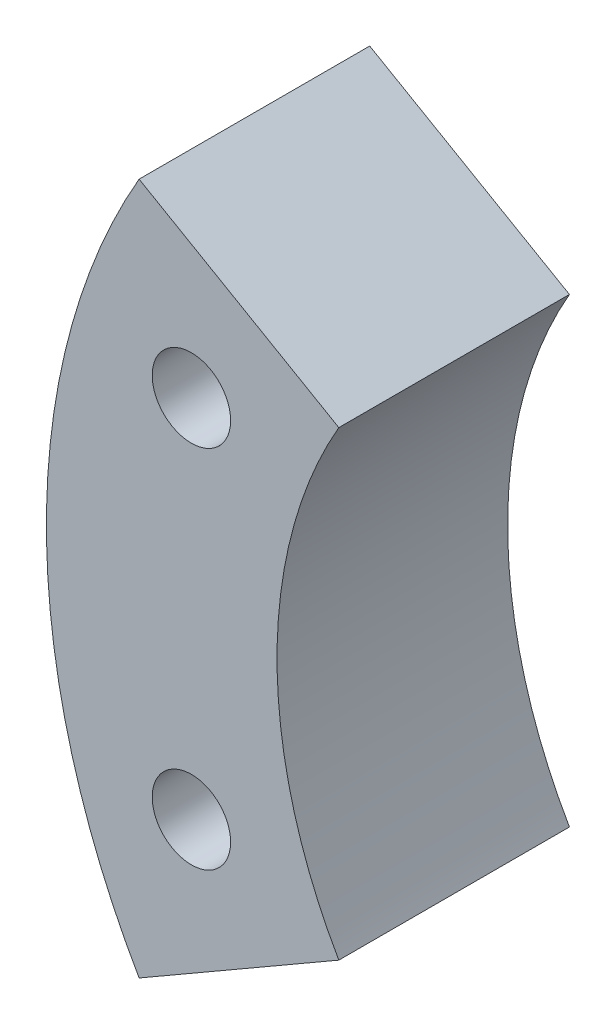
ISO-10303-21;
HEADER;
FILE_DESCRIPTION(('STEP AP214'),'2;1');
FILE_NAME('part.step','',(''),(''),'','','');
FILE_SCHEMA(('AUTOMOTIVE_DESIGN { 1 0 10303 214 1 1 1 1 }'));
ENDSEC;
DATA;
#1=APPLICATION_CONTEXT('core data for automotive mechanical design processes');
#2=APPLICATION_PROTOCOL_DEFINITION('international standard','automotive_design',2000,#1);
#3=PRODUCT_CONTEXT('',#1,'mechanical');
#4=PRODUCT('Part','Part','',(#3));
#5=PRODUCT_RELATED_PRODUCT_CATEGORY('part','',(#4));
#6=PRODUCT_DEFINITION_FORMATION('','',#4);
#7=PRODUCT_DEFINITION_CONTEXT('part definition',#1,'design');
#8=PRODUCT_DEFINITION('design','',#6,#7);
#9=PRODUCT_DEFINITION_SHAPE('','',#8);
#10=(LENGTH_UNIT() NAMED_UNIT(*) SI_UNIT(.MILLI.,.METRE.));
#11=(NAMED_UNIT(*) PLANE_ANGLE_UNIT() SI_UNIT($,.RADIAN.));
#12=(NAMED_UNIT(*) SI_UNIT($,.STERADIAN.) SOLID_ANGLE_UNIT());
#13=UNCERTAINTY_MEASURE_WITH_UNIT(LENGTH_MEASURE(1.E-05),#10,'distance_accuracy_value','');
#14=(GEOMETRIC_REPRESENTATION_CONTEXT(3) GLOBAL_UNCERTAINTY_ASSIGNED_CONTEXT((#13)) GLOBAL_UNIT_ASSIGNED_CONTEXT((#10,
#11,#12)) REPRESENTATION_CONTEXT('',''));
#15=CARTESIAN_POINT('',(0.,0.,0.));
#16=DIRECTION('',(0.,0.,1.));
#17=DIRECTION('',(1.,0.,0.));
#18=AXIS2_PLACEMENT_3D('',#15,#16,#17);
#19=CARTESIAN_POINT('',(0.,0.,6.35));
#20=DIRECTION('',(0.,0.,-1.));
#21=DIRECTION('',(-1.,0.,0.));
#22=AXIS2_PLACEMENT_3D('',#19,#20,#21);
#23=CYLINDRICAL_SURFACE('',#22,19.05);
#24=CARTESIAN_POINT('',(0.,0.,0.));
#25=DIRECTION('',(0.,0.,1.));
#26=DIRECTION('',(1.,0.,0.));
#27=AXIS2_PLACEMENT_3D('',#24,#25,#26);
#28=CIRCLE('',#27,19.05);
#29=CARTESIAN_POINT('',(-16.4977839420936,9.525,0.));
#30=VERTEX_POINT('',#29);
#31=CARTESIAN_POINT('',(-16.4977839420936,-9.525,0.));
#32=VERTEX_POINT('',#31);
#33=EDGE_CURVE('E112',#30,#32,#28,.T.);
#34=ORIENTED_EDGE('',*,*,#33,.T.);
#35=DIRECTION('',(0.,0.,-1.));
#36=VECTOR('',#35,1.);
#37=CARTESIAN_POINT('',(-16.4977839420936,-9.525,6.35));
#38=LINE('',#37,#36);
#39=CARTESIAN_POINT('',(-16.4977839420936,-9.525,6.35));
#40=VERTEX_POINT('',#39);
#41=EDGE_CURVE('E11',#40,#32,#38,.T.);
#42=ORIENTED_EDGE('',*,*,#41,.F.);
#43=CARTESIAN_POINT('',(0.,0.,6.35));
#44=DIRECTION('',(0.,0.,1.));
#45=DIRECTION('',(1.,0.,0.));
#46=AXIS2_PLACEMENT_3D('',#43,#44,#45);
#47=CIRCLE('',#46,19.05);
#48=CARTESIAN_POINT('',(-16.4977839420936,9.525,6.35));
#49=VERTEX_POINT('',#48);
#50=EDGE_CURVE('E96',#49,#40,#47,.T.);
#51=ORIENTED_EDGE('',*,*,#50,.F.);
#52=DIRECTION('',(0.,0.,-1.));
#53=VECTOR('',#52,1.);
#54=CARTESIAN_POINT('',(-16.4977839420936,9.525,6.35));
#55=LINE('',#54,#53);
#56=EDGE_CURVE('E108',#49,#30,#55,.T.);
#57=ORIENTED_EDGE('',*,*,#56,.T.);
#58=EDGE_LOOP('',(#34,#42,#51,#57));
#59=FACE_BOUND('',#58,.T.);
#60=ADVANCED_FACE('F44',(#59),#23,.T.);
#61=CARTESIAN_POINT('',(-16.4977839420936,-9.525,6.35));
#62=DIRECTION('',(-0.5,0.866025403784439,0.));
#63=DIRECTION('',(-0.866025403784439,-0.5,0.));
#64=AXIS2_PLACEMENT_3D('',#61,#62,#63);
#65=PLANE('',#64);
#66=DIRECTION('',(0.866025403784439,0.5,0.));
#67=VECTOR('',#66,1.);
#68=CARTESIAN_POINT('',(-16.4977839420936,-9.525,0.));
#69=LINE('',#68,#67);
#70=CARTESIAN_POINT('',(-10.9985226280624,-6.35,0.));
#71=VERTEX_POINT('',#70);
#72=EDGE_CURVE('E101',#32,#71,#69,.T.);
#73=ORIENTED_EDGE('',*,*,#72,.T.);
#74=DIRECTION('',(0.,0.,-1.));
#75=VECTOR('',#74,1.);
#76=CARTESIAN_POINT('',(-10.9985226280624,-6.35,6.35));
#77=LINE('',#76,#75);
#78=CARTESIAN_POINT('',(-10.9985226280624,-6.35,6.35));
#79=VERTEX_POINT('',#78);
#80=EDGE_CURVE('E53',#79,#71,#77,.T.);
#81=ORIENTED_EDGE('',*,*,#80,.F.);
#82=DIRECTION('',(0.866025403784439,0.5,0.));
#83=VECTOR('',#82,1.);
#84=CARTESIAN_POINT('',(-16.4977839420936,-9.525,6.35));
#85=LINE('',#84,#83);
#86=EDGE_CURVE('E91',#40,#79,#85,.T.);
#87=ORIENTED_EDGE('',*,*,#86,.F.);
#88=ORIENTED_EDGE('',*,*,#41,.T.);
#89=EDGE_LOOP('',(#73,#81,#87,#88));
#90=FACE_BOUND('',#89,.T.);
#91=ADVANCED_FACE('F100',(#90),#65,.F.);
#92=CARTESIAN_POINT('',(0.,0.,6.35));
#93=DIRECTION('',(0.,0.,-1.));
#94=DIRECTION('',(-1.,0.,0.));
#95=AXIS2_PLACEMENT_3D('',#92,#93,#94);
#96=CYLINDRICAL_SURFACE('',#95,12.7);
#97=CARTESIAN_POINT('',(0.,0.,0.));
#98=DIRECTION('',(0.,0.,-1.));
#99=DIRECTION('',(1.,0.,0.));
#100=AXIS2_PLACEMENT_3D('',#97,#98,#99);
#101=CIRCLE('',#100,12.7);
#102=CARTESIAN_POINT('',(-10.9985226280624,6.35,0.));
#103=VERTEX_POINT('',#102);
#104=EDGE_CURVE('E78',#71,#103,#101,.T.);
#105=ORIENTED_EDGE('',*,*,#104,.T.);
#106=DIRECTION('',(0.,0.,-1.));
#107=VECTOR('',#106,1.);
#108=CARTESIAN_POINT('',(-10.9985226280624,6.35,6.35));
#109=LINE('',#108,#107);
#110=CARTESIAN_POINT('',(-10.9985226280624,6.35,6.35));
#111=VERTEX_POINT('',#110);
#112=EDGE_CURVE('E103',#111,#103,#109,.T.);
#113=ORIENTED_EDGE('',*,*,#112,.F.);
#114=CARTESIAN_POINT('',(0.,0.,6.35));
#115=DIRECTION('',(0.,0.,-1.));
#116=DIRECTION('',(1.,0.,0.));
#117=AXIS2_PLACEMENT_3D('',#114,#115,#116);
#118=CIRCLE('',#117,12.7);
#119=EDGE_CURVE('E94',#79,#111,#118,.T.);
#120=ORIENTED_EDGE('',*,*,#119,.F.);
#121=ORIENTED_EDGE('',*,*,#80,.T.);
#122=EDGE_LOOP('',(#105,#113,#120,#121));
#123=FACE_BOUND('',#122,.T.);
#124=ADVANCED_FACE('F104',(#123),#96,.F.);
#125=CARTESIAN_POINT('',(-16.4977839420936,9.525,6.35));
#126=DIRECTION('',(-0.5,-0.866025403784439,0.));
#127=DIRECTION('',(0.866025403784439,-0.5,0.));
#128=AXIS2_PLACEMENT_3D('',#125,#126,#127);
#129=PLANE('',#128);
#130=DIRECTION('',(-0.866025403784439,0.5,0.));
#131=VECTOR('',#130,1.);
#132=CARTESIAN_POINT('',(-16.4977839420936,9.525,0.));
#133=LINE('',#132,#131);
#134=EDGE_CURVE('E84',#103,#30,#133,.T.);
#135=ORIENTED_EDGE('',*,*,#134,.T.);
#136=ORIENTED_EDGE('',*,*,#56,.F.);
#137=DIRECTION('',(-0.866025403784439,0.5,0.));
#138=VECTOR('',#137,1.);
#139=CARTESIAN_POINT('',(-16.4977839420936,9.525,6.35));
#140=LINE('',#139,#138);
#141=EDGE_CURVE('E61',#111,#49,#140,.T.);
#142=ORIENTED_EDGE('',*,*,#141,.F.);
#143=ORIENTED_EDGE('',*,*,#112,.T.);
#144=EDGE_LOOP('',(#135,#136,#142,#143));
#145=FACE_BOUND('',#144,.T.);
#146=ADVANCED_FACE('F126',(#145),#129,.F.);
#147=CARTESIAN_POINT('',(0.,0.,6.35));
#148=DIRECTION('',(0.,0.,1.));
#149=DIRECTION('',(1.,0.,0.));
#150=AXIS2_PLACEMENT_3D('',#147,#148,#149);
#151=PLANE('',#150);
#152=CARTESIAN_POINT('',(-15.0578841816037,5.027499276321,6.35));
#153=DIRECTION('',(0.,0.,1.));
#154=DIRECTION('',(1.,0.,0.));
#155=AXIS2_PLACEMENT_3D('',#152,#153,#154);
#156=CIRCLE('',#155,1.0795);
#157=CARTESIAN_POINT('',(-13.9783841816037,5.027499276321,6.35));
#158=VERTEX_POINT('',#157);
#159=EDGE_CURVE('E137',#158,#158,#156,.T.);
#160=ORIENTED_EDGE('',*,*,#159,.F.);
#161=EDGE_LOOP('',(#160));
#162=FACE_BOUND('',#161,.T.);
#163=CARTESIAN_POINT('',(-15.0578841816037,-5.027499276321,6.35));
#164=DIRECTION('',(0.,0.,1.));
#165=DIRECTION('',(1.,0.,0.));
#166=AXIS2_PLACEMENT_3D('',#163,#164,#165);
#167=CIRCLE('',#166,1.0795);
#168=CARTESIAN_POINT('',(-13.9783841816037,-5.027499276321,6.35));
#169=VERTEX_POINT('',#168);
#170=EDGE_CURVE('E133',#169,#169,#167,.T.);
#171=ORIENTED_EDGE('',*,*,#170,.F.);
#172=EDGE_LOOP('',(#171));
#173=FACE_BOUND('',#172,.T.);
#174=ORIENTED_EDGE('',*,*,#50,.T.);
#175=ORIENTED_EDGE('',*,*,#86,.T.);
#176=ORIENTED_EDGE('',*,*,#119,.T.);
#177=ORIENTED_EDGE('',*,*,#141,.T.);
#178=EDGE_LOOP('',(#174,#175,#176,#177));
#179=FACE_BOUND('',#178,.T.);
#180=ADVANCED_FACE('F92',(#162,#173,#179),#151,.T.);
#181=CARTESIAN_POINT('',(0.,0.,0.));
#182=DIRECTION('',(0.,0.,1.));
#183=DIRECTION('',(1.,0.,0.));
#184=AXIS2_PLACEMENT_3D('',#181,#182,#183);
#185=PLANE('',#184);
#186=CARTESIAN_POINT('',(-15.0578841816037,5.027499276321,0.));
#187=DIRECTION('',(0.,0.,1.));
#188=DIRECTION('',(1.,0.,0.));
#189=AXIS2_PLACEMENT_3D('',#186,#187,#188);
#190=CIRCLE('',#189,1.0795);
#191=CARTESIAN_POINT('',(-13.9783841816037,5.027499276321,0.));
#192=VERTEX_POINT('',#191);
#193=EDGE_CURVE('E116',#192,#192,#190,.F.);
#194=ORIENTED_EDGE('',*,*,#193,.F.);
#195=EDGE_LOOP('',(#194));
#196=FACE_BOUND('',#195,.T.);
#197=CARTESIAN_POINT('',(-15.0578841816037,-5.027499276321,0.));
#198=DIRECTION('',(0.,0.,1.));
#199=DIRECTION('',(1.,0.,0.));
#200=AXIS2_PLACEMENT_3D('',#197,#198,#199);
#201=CIRCLE('',#200,1.0795);
#202=CARTESIAN_POINT('',(-13.9783841816037,-5.027499276321,0.));
#203=VERTEX_POINT('',#202);
#204=EDGE_CURVE('E138',#203,#203,#201,.F.);
#205=ORIENTED_EDGE('',*,*,#204,.F.);
#206=EDGE_LOOP('',(#205));
#207=FACE_BOUND('',#206,.T.);
#208=ORIENTED_EDGE('',*,*,#33,.F.);
#209=ORIENTED_EDGE('',*,*,#134,.F.);
#210=ORIENTED_EDGE('',*,*,#104,.F.);
#211=ORIENTED_EDGE('',*,*,#72,.F.);
#212=EDGE_LOOP('',(#208,#209,#210,#211));
#213=FACE_BOUND('',#212,.T.);
#214=ADVANCED_FACE('F129',(#196,#207,#213),#185,.F.);
#215=CARTESIAN_POINT('',(-15.0578841816037,-5.027499276321,-0.00100000000000013));
#216=DIRECTION('',(0.,0.,1.));
#217=DIRECTION('',(1.,0.,0.));
#218=AXIS2_PLACEMENT_3D('',#215,#216,#217);
#219=CYLINDRICAL_SURFACE('',#218,1.0795);
#220=ORIENTED_EDGE('',*,*,#170,.T.);
#221=EDGE_LOOP('',(#220));
#222=FACE_BOUND('',#221,.T.);
#223=ORIENTED_EDGE('',*,*,#204,.T.);
#224=EDGE_LOOP('',(#223));
#225=FACE_BOUND('',#224,.T.);
#226=ADVANCED_FACE('F157',(#222,#225),#219,.F.);
#227=CARTESIAN_POINT('',(-15.0578841816037,5.027499276321,-0.00100000000000013));
#228=DIRECTION('',(0.,0.,1.));
#229=DIRECTION('',(1.,0.,0.));
#230=AXIS2_PLACEMENT_3D('',#227,#228,#229);
#231=CYLINDRICAL_SURFACE('',#230,1.0795);
#232=ORIENTED_EDGE('',*,*,#159,.T.);
#233=EDGE_LOOP('',(#232));
#234=FACE_BOUND('',#233,.T.);
#235=ORIENTED_EDGE('',*,*,#193,.T.);
#236=EDGE_LOOP('',(#235));
#237=FACE_BOUND('',#236,.T.);
#238=ADVANCED_FACE('F149',(#234,#237),#231,.F.);
#239=CLOSED_SHELL('',(#60,#91,#124,#146,#180,#214,#226,#238));
#240=MANIFOLD_SOLID_BREP('B2',#239);
#241=ADVANCED_BREP_SHAPE_REPRESENTATION('',(#18,#240),#14);
#242=SHAPE_DEFINITION_REPRESENTATION(#9,#241);
ENDSEC;
END-ISO-10303-21;
